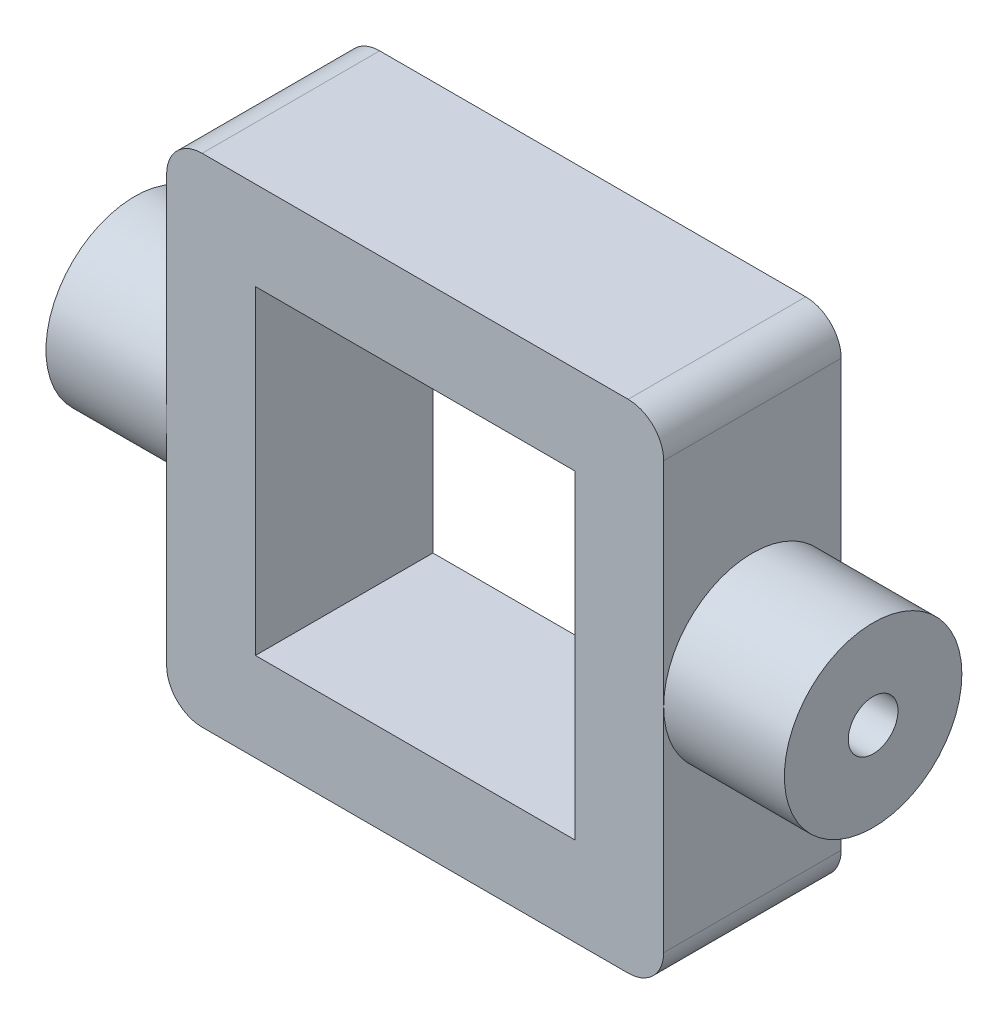
ISO-10303-21;
HEADER;
FILE_DESCRIPTION(('STEP AP214'),'2;1');
FILE_NAME('part.step','',(''),(''),'','','');
FILE_SCHEMA(('AUTOMOTIVE_DESIGN { 1 0 10303 214 1 1 1 1 }'));
ENDSEC;
DATA;
#1=APPLICATION_CONTEXT('core data for automotive mechanical design processes');
#2=APPLICATION_PROTOCOL_DEFINITION('international standard','automotive_design',2000,#1);
#3=PRODUCT_CONTEXT('',#1,'mechanical');
#4=PRODUCT('Part','Part','',(#3));
#5=PRODUCT_RELATED_PRODUCT_CATEGORY('part','',(#4));
#6=PRODUCT_DEFINITION_FORMATION('','',#4);
#7=PRODUCT_DEFINITION_CONTEXT('part definition',#1,'design');
#8=PRODUCT_DEFINITION('design','',#6,#7);
#9=PRODUCT_DEFINITION_SHAPE('','',#8);
#10=(LENGTH_UNIT() NAMED_UNIT(*) SI_UNIT(.MILLI.,.METRE.));
#11=(NAMED_UNIT(*) PLANE_ANGLE_UNIT() SI_UNIT($,.RADIAN.));
#12=(NAMED_UNIT(*) SI_UNIT($,.STERADIAN.) SOLID_ANGLE_UNIT());
#13=UNCERTAINTY_MEASURE_WITH_UNIT(LENGTH_MEASURE(1.E-05),#10,'distance_accuracy_value','');
#14=(GEOMETRIC_REPRESENTATION_CONTEXT(3) GLOBAL_UNCERTAINTY_ASSIGNED_CONTEXT((#13)) GLOBAL_UNIT_ASSIGNED_CONTEXT((#10,
#11,#12)) REPRESENTATION_CONTEXT('',''));
#15=CARTESIAN_POINT('',(0.,0.,0.));
#16=DIRECTION('',(0.,0.,1.));
#17=DIRECTION('',(1.,0.,0.));
#18=AXIS2_PLACEMENT_3D('',#15,#16,#17);
#19=CARTESIAN_POINT('',(-7.,-7.,2.5));
#20=DIRECTION('',(1.,0.,0.));
#21=DIRECTION('',(0.,0.,-1.));
#22=AXIS2_PLACEMENT_3D('',#19,#20,#21);
#23=PLANE('',#22);
#24=DIRECTION('',(0.,-1.,0.));
#25=VECTOR('',#24,1.);
#26=CARTESIAN_POINT('',(-7.,-7.,2.5));
#27=LINE('',#26,#25);
#28=CARTESIAN_POINT('',(-7.,6.,2.5));
#29=VERTEX_POINT('',#28);
#30=CARTESIAN_POINT('',(-7.,0.,2.5));
#31=VERTEX_POINT('',#30);
#32=EDGE_CURVE('E135',#29,#31,#27,.T.);
#33=ORIENTED_EDGE('',*,*,#32,.F.);
#34=DIRECTION('',(0.,0.,-1.));
#35=VECTOR('',#34,1.);
#36=CARTESIAN_POINT('',(-7.,6.,2.5));
#37=LINE('',#36,#35);
#38=CARTESIAN_POINT('',(-7.,6.,-2.5));
#39=VERTEX_POINT('',#38);
#40=EDGE_CURVE('E160',#29,#39,#37,.T.);
#41=ORIENTED_EDGE('',*,*,#40,.T.);
#42=DIRECTION('',(0.,-1.,0.));
#43=VECTOR('',#42,1.);
#44=CARTESIAN_POINT('',(-7.,-7.,-2.5));
#45=LINE('',#44,#43);
#46=CARTESIAN_POINT('',(-7.,0.,-2.5));
#47=VERTEX_POINT('',#46);
#48=EDGE_CURVE('E164',#39,#47,#45,.T.);
#49=ORIENTED_EDGE('',*,*,#48,.T.);
#50=CARTESIAN_POINT('',(-7.,0.,0.));
#51=DIRECTION('',(1.,0.,0.));
#52=DIRECTION('',(0.,0.,-1.));
#53=AXIS2_PLACEMENT_3D('',#50,#51,#52);
#54=CIRCLE('',#53,2.5);
#55=EDGE_CURVE('E156',#47,#31,#54,.T.);
#56=ORIENTED_EDGE('',*,*,#55,.T.);
#57=EDGE_LOOP('',(#33,#41,#49,#56));
#58=FACE_BOUND('',#57,.T.);
#59=ADVANCED_FACE('F34',(#58),#23,.F.);
#60=CARTESIAN_POINT('',(7.,-7.,2.5));
#61=DIRECTION('',(-1.,0.,0.));
#62=DIRECTION('',(0.,0.,1.));
#63=AXIS2_PLACEMENT_3D('',#60,#61,#62);
#64=PLANE('',#63);
#65=DIRECTION('',(0.,1.,0.));
#66=VECTOR('',#65,1.);
#67=CARTESIAN_POINT('',(7.,-7.,-2.5));
#68=LINE('',#67,#66);
#69=CARTESIAN_POINT('',(7.,0.,-2.5));
#70=VERTEX_POINT('',#69);
#71=CARTESIAN_POINT('',(7.,6.,-2.5));
#72=VERTEX_POINT('',#71);
#73=EDGE_CURVE('E189',#70,#72,#68,.T.);
#74=ORIENTED_EDGE('',*,*,#73,.T.);
#75=DIRECTION('',(0.,0.,-1.));
#76=VECTOR('',#75,1.);
#77=CARTESIAN_POINT('',(7.,6.,2.5));
#78=LINE('',#77,#76);
#79=CARTESIAN_POINT('',(7.,6.,2.5));
#80=VERTEX_POINT('',#79);
#81=EDGE_CURVE('E11',#72,#80,#78,.F.);
#82=ORIENTED_EDGE('',*,*,#81,.T.);
#83=DIRECTION('',(0.,1.,0.));
#84=VECTOR('',#83,1.);
#85=CARTESIAN_POINT('',(7.,-7.,2.5));
#86=LINE('',#85,#84);
#87=CARTESIAN_POINT('',(7.,0.,2.5));
#88=VERTEX_POINT('',#87);
#89=EDGE_CURVE('E179',#88,#80,#86,.T.);
#90=ORIENTED_EDGE('',*,*,#89,.F.);
#91=CARTESIAN_POINT('',(7.,0.,0.));
#92=DIRECTION('',(1.,0.,0.));
#93=DIRECTION('',(0.,0.,-1.));
#94=AXIS2_PLACEMENT_3D('',#91,#92,#93);
#95=CIRCLE('',#94,2.5);
#96=EDGE_CURVE('E231',#70,#88,#95,.T.);
#97=ORIENTED_EDGE('',*,*,#96,.F.);
#98=EDGE_LOOP('',(#74,#82,#90,#97));
#99=FACE_BOUND('',#98,.T.);
#100=ADVANCED_FACE('F233',(#99),#64,.F.);
#101=CARTESIAN_POINT('',(0.,0.,2.5));
#102=DIRECTION('',(0.,0.,1.));
#103=DIRECTION('',(1.,0.,0.));
#104=AXIS2_PLACEMENT_3D('',#101,#102,#103);
#105=PLANE('',#104);
#106=DIRECTION('',(-1.,0.,0.));
#107=VECTOR('',#106,1.);
#108=CARTESIAN_POINT('',(7.,7.,2.5));
#109=LINE('',#108,#107);
#110=CARTESIAN_POINT('',(6.,7.,2.5));
#111=VERTEX_POINT('',#110);
#112=CARTESIAN_POINT('',(-6.,7.,2.5));
#113=VERTEX_POINT('',#112);
#114=EDGE_CURVE('E182',#111,#113,#109,.T.);
#115=ORIENTED_EDGE('',*,*,#114,.T.);
#116=CARTESIAN_POINT('',(-6.,6.,2.5));
#117=DIRECTION('',(0.,0.,1.));
#118=DIRECTION('',(1.,0.,0.));
#119=AXIS2_PLACEMENT_3D('',#116,#117,#118);
#120=CIRCLE('',#119,1.);
#121=EDGE_CURVE('E144',#113,#29,#120,.T.);
#122=ORIENTED_EDGE('',*,*,#121,.T.);
#123=ORIENTED_EDGE('',*,*,#32,.T.);
#124=CARTESIAN_POINT('',(-7.,-6.,2.5));
#125=VERTEX_POINT('',#124);
#126=EDGE_CURVE('E141',#31,#125,#27,.T.);
#127=ORIENTED_EDGE('',*,*,#126,.T.);
#128=CARTESIAN_POINT('',(-6.,-6.,2.5));
#129=DIRECTION('',(0.,0.,1.));
#130=DIRECTION('',(1.,0.,0.));
#131=AXIS2_PLACEMENT_3D('',#128,#129,#130);
#132=CIRCLE('',#131,1.);
#133=CARTESIAN_POINT('',(-6.,-7.,2.5));
#134=VERTEX_POINT('',#133);
#135=EDGE_CURVE('E208',#125,#134,#132,.T.);
#136=ORIENTED_EDGE('',*,*,#135,.T.);
#137=DIRECTION('',(1.,0.,0.));
#138=VECTOR('',#137,1.);
#139=CARTESIAN_POINT('',(7.,-7.,2.5));
#140=LINE('',#139,#138);
#141=CARTESIAN_POINT('',(6.,-7.,2.5));
#142=VERTEX_POINT('',#141);
#143=EDGE_CURVE('E149',#134,#142,#140,.T.);
#144=ORIENTED_EDGE('',*,*,#143,.T.);
#145=CARTESIAN_POINT('',(6.,-6.,2.5));
#146=DIRECTION('',(0.,0.,1.));
#147=DIRECTION('',(1.,0.,0.));
#148=AXIS2_PLACEMENT_3D('',#145,#146,#147);
#149=CIRCLE('',#148,1.);
#150=CARTESIAN_POINT('',(7.,-6.,2.5));
#151=VERTEX_POINT('',#150);
#152=EDGE_CURVE('E55',#142,#151,#149,.T.);
#153=ORIENTED_EDGE('',*,*,#152,.T.);
#154=EDGE_CURVE('E180',#151,#88,#86,.T.);
#155=ORIENTED_EDGE('',*,*,#154,.T.);
#156=ORIENTED_EDGE('',*,*,#89,.T.);
#157=CARTESIAN_POINT('',(6.,6.,2.5));
#158=DIRECTION('',(0.,0.,1.));
#159=DIRECTION('',(1.,0.,0.));
#160=AXIS2_PLACEMENT_3D('',#157,#158,#159);
#161=CIRCLE('',#160,1.);
#162=EDGE_CURVE('E205',#80,#111,#161,.T.);
#163=ORIENTED_EDGE('',*,*,#162,.T.);
#164=EDGE_LOOP('',(#115,#122,#123,#127,#136,#144,#153,#155,#156,#163));
#165=FACE_BOUND('',#164,.T.);
#166=DIRECTION('',(1.,0.,0.));
#167=VECTOR('',#166,1.);
#168=CARTESIAN_POINT('',(4.5,-4.5,2.5));
#169=LINE('',#168,#167);
#170=CARTESIAN_POINT('',(-4.5,-4.5,2.5));
#171=VERTEX_POINT('',#170);
#172=CARTESIAN_POINT('',(4.5,-4.5,2.5));
#173=VERTEX_POINT('',#172);
#174=EDGE_CURVE('E244',#171,#173,#169,.T.);
#175=ORIENTED_EDGE('',*,*,#174,.F.);
#176=DIRECTION('',(0.,-1.,0.));
#177=VECTOR('',#176,1.);
#178=CARTESIAN_POINT('',(-4.5,-4.5,2.5));
#179=LINE('',#178,#177);
#180=CARTESIAN_POINT('',(-4.5,4.5,2.5));
#181=VERTEX_POINT('',#180);
#182=EDGE_CURVE('E242',#181,#171,#179,.T.);
#183=ORIENTED_EDGE('',*,*,#182,.F.);
#184=DIRECTION('',(-1.,0.,0.));
#185=VECTOR('',#184,1.);
#186=CARTESIAN_POINT('',(4.5,4.5,2.5));
#187=LINE('',#186,#185);
#188=CARTESIAN_POINT('',(4.5,4.5,2.5));
#189=VERTEX_POINT('',#188);
#190=EDGE_CURVE('E250',#189,#181,#187,.T.);
#191=ORIENTED_EDGE('',*,*,#190,.F.);
#192=DIRECTION('',(0.,1.,0.));
#193=VECTOR('',#192,1.);
#194=CARTESIAN_POINT('',(4.5,-4.5,2.5));
#195=LINE('',#194,#193);
#196=EDGE_CURVE('E247',#173,#189,#195,.T.);
#197=ORIENTED_EDGE('',*,*,#196,.F.);
#198=EDGE_LOOP('',(#175,#183,#191,#197));
#199=FACE_BOUND('',#198,.T.);
#200=ADVANCED_FACE('F138',(#165,#199),#105,.T.);
#201=CARTESIAN_POINT('',(0.,0.,-2.5));
#202=DIRECTION('',(0.,0.,1.));
#203=DIRECTION('',(1.,0.,0.));
#204=AXIS2_PLACEMENT_3D('',#201,#202,#203);
#205=PLANE('',#204);
#206=ORIENTED_EDGE('',*,*,#48,.F.);
#207=CARTESIAN_POINT('',(-6.,6.,-2.5));
#208=DIRECTION('',(0.,0.,1.));
#209=DIRECTION('',(1.,0.,0.));
#210=AXIS2_PLACEMENT_3D('',#207,#208,#209);
#211=CIRCLE('',#210,1.);
#212=CARTESIAN_POINT('',(-6.,7.,-2.5));
#213=VERTEX_POINT('',#212);
#214=EDGE_CURVE('E198',#39,#213,#211,.F.);
#215=ORIENTED_EDGE('',*,*,#214,.T.);
#216=DIRECTION('',(-1.,0.,0.));
#217=VECTOR('',#216,1.);
#218=CARTESIAN_POINT('',(7.,7.,-2.5));
#219=LINE('',#218,#217);
#220=CARTESIAN_POINT('',(6.,7.,-2.5));
#221=VERTEX_POINT('',#220);
#222=EDGE_CURVE('E170',#221,#213,#219,.T.);
#223=ORIENTED_EDGE('',*,*,#222,.F.);
#224=CARTESIAN_POINT('',(6.,6.,-2.5));
#225=DIRECTION('',(0.,0.,1.));
#226=DIRECTION('',(1.,0.,0.));
#227=AXIS2_PLACEMENT_3D('',#224,#225,#226);
#228=CIRCLE('',#227,1.);
#229=EDGE_CURVE('E192',#221,#72,#228,.F.);
#230=ORIENTED_EDGE('',*,*,#229,.T.);
#231=ORIENTED_EDGE('',*,*,#73,.F.);
#232=CARTESIAN_POINT('',(7.,-6.,-2.5));
#233=VERTEX_POINT('',#232);
#234=EDGE_CURVE('E172',#233,#70,#68,.T.);
#235=ORIENTED_EDGE('',*,*,#234,.F.);
#236=CARTESIAN_POINT('',(6.,-6.,-2.5));
#237=DIRECTION('',(0.,0.,1.));
#238=DIRECTION('',(1.,0.,0.));
#239=AXIS2_PLACEMENT_3D('',#236,#237,#238);
#240=CIRCLE('',#239,1.);
#241=CARTESIAN_POINT('',(6.,-7.,-2.5));
#242=VERTEX_POINT('',#241);
#243=EDGE_CURVE('E194',#233,#242,#240,.F.);
#244=ORIENTED_EDGE('',*,*,#243,.T.);
#245=DIRECTION('',(1.,0.,0.));
#246=VECTOR('',#245,1.);
#247=CARTESIAN_POINT('',(7.,-7.,-2.5));
#248=LINE('',#247,#246);
#249=CARTESIAN_POINT('',(-6.,-7.,-2.5));
#250=VERTEX_POINT('',#249);
#251=EDGE_CURVE('E185',#250,#242,#248,.T.);
#252=ORIENTED_EDGE('',*,*,#251,.F.);
#253=CARTESIAN_POINT('',(-6.,-6.,-2.5));
#254=DIRECTION('',(0.,0.,1.));
#255=DIRECTION('',(1.,0.,0.));
#256=AXIS2_PLACEMENT_3D('',#253,#254,#255);
#257=CIRCLE('',#256,1.);
#258=CARTESIAN_POINT('',(-7.,-6.,-2.5));
#259=VERTEX_POINT('',#258);
#260=EDGE_CURVE('E196',#250,#259,#257,.F.);
#261=ORIENTED_EDGE('',*,*,#260,.T.);
#262=EDGE_CURVE('E186',#47,#259,#45,.T.);
#263=ORIENTED_EDGE('',*,*,#262,.F.);
#264=EDGE_LOOP('',(#206,#215,#223,#230,#231,#235,#244,#252,#261,#263));
#265=FACE_BOUND('',#264,.T.);
#266=DIRECTION('',(0.,-1.,0.));
#267=VECTOR('',#266,1.);
#268=CARTESIAN_POINT('',(-4.5,-4.5,-2.5));
#269=LINE('',#268,#267);
#270=CARTESIAN_POINT('',(-4.5,4.5,-2.5));
#271=VERTEX_POINT('',#270);
#272=CARTESIAN_POINT('',(-4.5,-4.5,-2.5));
#273=VERTEX_POINT('',#272);
#274=EDGE_CURVE('E253',#271,#273,#269,.T.);
#275=ORIENTED_EDGE('',*,*,#274,.T.);
#276=DIRECTION('',(1.,0.,0.));
#277=VECTOR('',#276,1.);
#278=CARTESIAN_POINT('',(4.5,-4.5,-2.5));
#279=LINE('',#278,#277);
#280=CARTESIAN_POINT('',(4.5,-4.5,-2.5));
#281=VERTEX_POINT('',#280);
#282=EDGE_CURVE('E256',#273,#281,#279,.T.);
#283=ORIENTED_EDGE('',*,*,#282,.T.);
#284=DIRECTION('',(0.,1.,0.));
#285=VECTOR('',#284,1.);
#286=CARTESIAN_POINT('',(4.5,-4.5,-2.5));
#287=LINE('',#286,#285);
#288=CARTESIAN_POINT('',(4.5,4.5,-2.5));
#289=VERTEX_POINT('',#288);
#290=EDGE_CURVE('E259',#281,#289,#287,.T.);
#291=ORIENTED_EDGE('',*,*,#290,.T.);
#292=DIRECTION('',(-1.,0.,0.));
#293=VECTOR('',#292,1.);
#294=CARTESIAN_POINT('',(4.5,4.5,-2.5));
#295=LINE('',#294,#293);
#296=EDGE_CURVE('E245',#289,#271,#295,.T.);
#297=ORIENTED_EDGE('',*,*,#296,.T.);
#298=EDGE_LOOP('',(#275,#283,#291,#297));
#299=FACE_BOUND('',#298,.T.);
#300=ADVANCED_FACE('F225',(#265,#299),#205,.F.);
#301=ORIENTED_EDGE('',*,*,#262,.T.);
#302=DIRECTION('',(0.,0.,-1.));
#303=VECTOR('',#302,1.);
#304=CARTESIAN_POINT('',(-7.,-6.,2.5));
#305=LINE('',#304,#303);
#306=EDGE_CURVE('E169',#259,#125,#305,.F.);
#307=ORIENTED_EDGE('',*,*,#306,.T.);
#308=ORIENTED_EDGE('',*,*,#126,.F.);
#309=EDGE_CURVE('E154',#31,#47,#54,.T.);
#310=ORIENTED_EDGE('',*,*,#309,.T.);
#311=EDGE_LOOP('',(#301,#307,#308,#310));
#312=FACE_BOUND('',#311,.T.);
#313=ADVANCED_FACE('F167',(#312),#23,.F.);
#314=CARTESIAN_POINT('',(7.,-7.,2.5));
#315=DIRECTION('',(0.,1.,0.));
#316=DIRECTION('',(0.,0.,1.));
#317=AXIS2_PLACEMENT_3D('',#314,#315,#316);
#318=PLANE('',#317);
#319=ORIENTED_EDGE('',*,*,#143,.F.);
#320=DIRECTION('',(0.,0.,-1.));
#321=VECTOR('',#320,1.);
#322=CARTESIAN_POINT('',(-6.,-7.,2.5));
#323=LINE('',#322,#321);
#324=EDGE_CURVE('E213',#134,#250,#323,.T.);
#325=ORIENTED_EDGE('',*,*,#324,.T.);
#326=ORIENTED_EDGE('',*,*,#251,.T.);
#327=DIRECTION('',(0.,0.,-1.));
#328=VECTOR('',#327,1.);
#329=CARTESIAN_POINT('',(6.,-7.,2.5));
#330=LINE('',#329,#328);
#331=EDGE_CURVE('E211',#242,#142,#330,.F.);
#332=ORIENTED_EDGE('',*,*,#331,.T.);
#333=EDGE_LOOP('',(#319,#325,#326,#332));
#334=FACE_BOUND('',#333,.T.);
#335=ADVANCED_FACE('F279',(#334),#318,.F.);
#336=ORIENTED_EDGE('',*,*,#154,.F.);
#337=DIRECTION('',(0.,0.,-1.));
#338=VECTOR('',#337,1.);
#339=CARTESIAN_POINT('',(7.,-6.,2.5));
#340=LINE('',#339,#338);
#341=EDGE_CURVE('E42',#151,#233,#340,.T.);
#342=ORIENTED_EDGE('',*,*,#341,.T.);
#343=ORIENTED_EDGE('',*,*,#234,.T.);
#344=EDGE_CURVE('E161',#88,#70,#95,.T.);
#345=ORIENTED_EDGE('',*,*,#344,.F.);
#346=EDGE_LOOP('',(#336,#342,#343,#345));
#347=FACE_BOUND('',#346,.T.);
#348=ADVANCED_FACE('F220',(#347),#64,.F.);
#349=CARTESIAN_POINT('',(7.,7.,2.5));
#350=DIRECTION('',(0.,-1.,0.));
#351=DIRECTION('',(0.,0.,-1.));
#352=AXIS2_PLACEMENT_3D('',#349,#350,#351);
#353=PLANE('',#352);
#354=ORIENTED_EDGE('',*,*,#222,.T.);
#355=DIRECTION('',(0.,0.,-1.));
#356=VECTOR('',#355,1.);
#357=CARTESIAN_POINT('',(-6.,7.,2.5));
#358=LINE('',#357,#356);
#359=EDGE_CURVE('E203',#213,#113,#358,.F.);
#360=ORIENTED_EDGE('',*,*,#359,.T.);
#361=ORIENTED_EDGE('',*,*,#114,.F.);
#362=DIRECTION('',(0.,0.,-1.));
#363=VECTOR('',#362,1.);
#364=CARTESIAN_POINT('',(6.,7.,2.5));
#365=LINE('',#364,#363);
#366=EDGE_CURVE('E200',#111,#221,#365,.T.);
#367=ORIENTED_EDGE('',*,*,#366,.T.);
#368=EDGE_LOOP('',(#354,#360,#361,#367));
#369=FACE_BOUND('',#368,.T.);
#370=ADVANCED_FACE('F310',(#369),#353,.F.);
#371=CARTESIAN_POINT('',(-4.5,-4.5,2.5));
#372=DIRECTION('',(1.,0.,0.));
#373=DIRECTION('',(0.,0.,-1.));
#374=AXIS2_PLACEMENT_3D('',#371,#372,#373);
#375=PLANE('',#374);
#376=ORIENTED_EDGE('',*,*,#274,.F.);
#377=DIRECTION('',(0.,0.,-1.));
#378=VECTOR('',#377,1.);
#379=CARTESIAN_POINT('',(-4.5,4.5,2.5));
#380=LINE('',#379,#378);
#381=EDGE_CURVE('E252',#181,#271,#380,.T.);
#382=ORIENTED_EDGE('',*,*,#381,.F.);
#383=ORIENTED_EDGE('',*,*,#182,.T.);
#384=DIRECTION('',(0.,0.,-1.));
#385=VECTOR('',#384,1.);
#386=CARTESIAN_POINT('',(-4.5,-4.5,2.5));
#387=LINE('',#386,#385);
#388=EDGE_CURVE('E176',#171,#273,#387,.T.);
#389=ORIENTED_EDGE('',*,*,#388,.T.);
#390=EDGE_LOOP('',(#376,#382,#383,#389));
#391=FACE_BOUND('',#390,.T.);
#392=ADVANCED_FACE('F312',(#391),#375,.T.);
#393=CARTESIAN_POINT('',(4.5,-4.5,2.5));
#394=DIRECTION('',(0.,1.,0.));
#395=DIRECTION('',(0.,0.,1.));
#396=AXIS2_PLACEMENT_3D('',#393,#394,#395);
#397=PLANE('',#396);
#398=ORIENTED_EDGE('',*,*,#282,.F.);
#399=ORIENTED_EDGE('',*,*,#388,.F.);
#400=ORIENTED_EDGE('',*,*,#174,.T.);
#401=DIRECTION('',(0.,0.,-1.));
#402=VECTOR('',#401,1.);
#403=CARTESIAN_POINT('',(4.5,-4.5,2.5));
#404=LINE('',#403,#402);
#405=EDGE_CURVE('E267',#173,#281,#404,.T.);
#406=ORIENTED_EDGE('',*,*,#405,.T.);
#407=EDGE_LOOP('',(#398,#399,#400,#406));
#408=FACE_BOUND('',#407,.T.);
#409=ADVANCED_FACE('F330',(#408),#397,.T.);
#410=CARTESIAN_POINT('',(4.5,-4.5,2.5));
#411=DIRECTION('',(-1.,0.,0.));
#412=DIRECTION('',(0.,0.,1.));
#413=AXIS2_PLACEMENT_3D('',#410,#411,#412);
#414=PLANE('',#413);
#415=ORIENTED_EDGE('',*,*,#290,.F.);
#416=ORIENTED_EDGE('',*,*,#405,.F.);
#417=ORIENTED_EDGE('',*,*,#196,.T.);
#418=DIRECTION('',(0.,0.,-1.));
#419=VECTOR('',#418,1.);
#420=CARTESIAN_POINT('',(4.5,4.5,2.5));
#421=LINE('',#420,#419);
#422=EDGE_CURVE('E266',#189,#289,#421,.T.);
#423=ORIENTED_EDGE('',*,*,#422,.T.);
#424=EDGE_LOOP('',(#415,#416,#417,#423));
#425=FACE_BOUND('',#424,.T.);
#426=ADVANCED_FACE('F336',(#425),#414,.T.);
#427=CARTESIAN_POINT('',(4.5,4.5,2.5));
#428=DIRECTION('',(0.,-1.,0.));
#429=DIRECTION('',(0.,0.,-1.));
#430=AXIS2_PLACEMENT_3D('',#427,#428,#429);
#431=PLANE('',#430);
#432=ORIENTED_EDGE('',*,*,#296,.F.);
#433=ORIENTED_EDGE('',*,*,#422,.F.);
#434=ORIENTED_EDGE('',*,*,#190,.T.);
#435=ORIENTED_EDGE('',*,*,#381,.T.);
#436=EDGE_LOOP('',(#432,#433,#434,#435));
#437=FACE_BOUND('',#436,.T.);
#438=ADVANCED_FACE('F343',(#437),#431,.T.);
#439=CARTESIAN_POINT('',(10.4,0.,0.));
#440=DIRECTION('',(-1.,0.,0.));
#441=DIRECTION('',(0.,0.,1.));
#442=AXIS2_PLACEMENT_3D('',#439,#440,#441);
#443=CYLINDRICAL_SURFACE('',#442,2.5);
#444=CARTESIAN_POINT('',(10.4,0.,0.));
#445=DIRECTION('',(1.,0.,0.));
#446=DIRECTION('',(0.,0.,-1.));
#447=AXIS2_PLACEMENT_3D('',#444,#445,#446);
#448=CIRCLE('',#447,2.5);
#449=CARTESIAN_POINT('',(10.4,0.,-2.5));
#450=VERTEX_POINT('',#449);
#451=EDGE_CURVE('E235',#450,#450,#448,.T.);
#452=ORIENTED_EDGE('',*,*,#451,.F.);
#453=EDGE_LOOP('',(#452));
#454=FACE_BOUND('',#453,.T.);
#455=ORIENTED_EDGE('',*,*,#96,.T.);
#456=ORIENTED_EDGE('',*,*,#344,.T.);
#457=EDGE_LOOP('',(#455,#456));
#458=FACE_BOUND('',#457,.T.);
#459=ADVANCED_FACE('F238',(#454,#458),#443,.T.);
#460=CARTESIAN_POINT('',(10.4,0.,0.));
#461=DIRECTION('',(1.,0.,0.));
#462=DIRECTION('',(0.,0.,-1.));
#463=AXIS2_PLACEMENT_3D('',#460,#461,#462);
#464=PLANE('',#463);
#465=CARTESIAN_POINT('',(10.4,0.,0.));
#466=DIRECTION('',(1.,0.,0.));
#467=DIRECTION('',(0.,0.,-1.));
#468=AXIS2_PLACEMENT_3D('',#465,#466,#467);
#469=CIRCLE('',#468,0.7);
#470=CARTESIAN_POINT('',(10.4,0.,-0.7));
#471=VERTEX_POINT('',#470);
#472=EDGE_CURVE('E507',#471,#471,#469,.T.);
#473=ORIENTED_EDGE('',*,*,#472,.F.);
#474=EDGE_LOOP('',(#473));
#475=FACE_BOUND('',#474,.T.);
#476=ORIENTED_EDGE('',*,*,#451,.T.);
#477=EDGE_LOOP('',(#476));
#478=FACE_BOUND('',#477,.T.);
#479=ADVANCED_FACE('F358',(#475,#478),#464,.T.);
#480=CARTESIAN_POINT('',(5.4,0.,0.));
#481=DIRECTION('',(1.,0.,0.));
#482=DIRECTION('',(0.,0.,-1.));
#483=AXIS2_PLACEMENT_3D('',#480,#481,#482);
#484=CYLINDRICAL_SURFACE('',#483,0.7);
#485=CARTESIAN_POINT('',(5.4,0.,0.));
#486=DIRECTION('',(1.,0.,0.));
#487=DIRECTION('',(0.,0.,-1.));
#488=AXIS2_PLACEMENT_3D('',#485,#486,#487);
#489=CIRCLE('',#488,0.7);
#490=CARTESIAN_POINT('',(5.4,0.,-0.7));
#491=VERTEX_POINT('',#490);
#492=EDGE_CURVE('E236',#491,#491,#489,.T.);
#493=ORIENTED_EDGE('',*,*,#492,.F.);
#494=EDGE_LOOP('',(#493));
#495=FACE_BOUND('',#494,.T.);
#496=ORIENTED_EDGE('',*,*,#472,.T.);
#497=EDGE_LOOP('',(#496));
#498=FACE_BOUND('',#497,.T.);
#499=ADVANCED_FACE('F366',(#495,#498),#484,.F.);
#500=CARTESIAN_POINT('',(5.4,0.,0.));
#501=DIRECTION('',(1.,0.,0.));
#502=DIRECTION('',(0.,0.,-1.));
#503=AXIS2_PLACEMENT_3D('',#500,#501,#502);
#504=PLANE('',#503);
#505=ORIENTED_EDGE('',*,*,#492,.T.);
#506=EDGE_LOOP('',(#505));
#507=FACE_BOUND('',#506,.T.);
#508=ADVANCED_FACE('F374',(#507),#504,.T.);
#509=CARTESIAN_POINT('',(-10.4,0.,0.));
#510=DIRECTION('',(1.,0.,0.));
#511=DIRECTION('',(0.,0.,-1.));
#512=AXIS2_PLACEMENT_3D('',#509,#510,#511);
#513=CYLINDRICAL_SURFACE('',#512,2.5);
#514=CARTESIAN_POINT('',(-10.4,0.,0.));
#515=DIRECTION('',(1.,0.,0.));
#516=DIRECTION('',(0.,0.,-1.));
#517=AXIS2_PLACEMENT_3D('',#514,#515,#516);
#518=CIRCLE('',#517,2.5);
#519=CARTESIAN_POINT('',(-10.4,0.,-2.5));
#520=VERTEX_POINT('',#519);
#521=EDGE_CURVE('E165',#520,#520,#518,.T.);
#522=ORIENTED_EDGE('',*,*,#521,.T.);
#523=EDGE_LOOP('',(#522));
#524=FACE_BOUND('',#523,.T.);
#525=ORIENTED_EDGE('',*,*,#55,.F.);
#526=ORIENTED_EDGE('',*,*,#309,.F.);
#527=EDGE_LOOP('',(#525,#526));
#528=FACE_BOUND('',#527,.T.);
#529=ADVANCED_FACE('F155',(#524,#528),#513,.T.);
#530=CARTESIAN_POINT('',(-10.4,0.,0.));
#531=DIRECTION('',(-1.,0.,0.));
#532=DIRECTION('',(0.,0.,-1.));
#533=AXIS2_PLACEMENT_3D('',#530,#531,#532);
#534=PLANE('',#533);
#535=CARTESIAN_POINT('',(-10.4,0.,0.));
#536=DIRECTION('',(1.,0.,0.));
#537=DIRECTION('',(0.,0.,-1.));
#538=AXIS2_PLACEMENT_3D('',#535,#536,#537);
#539=CIRCLE('',#538,0.7);
#540=CARTESIAN_POINT('',(-10.4,0.,-0.7));
#541=VERTEX_POINT('',#540);
#542=EDGE_CURVE('E501',#541,#541,#539,.T.);
#543=ORIENTED_EDGE('',*,*,#542,.T.);
#544=EDGE_LOOP('',(#543));
#545=FACE_BOUND('',#544,.T.);
#546=ORIENTED_EDGE('',*,*,#521,.F.);
#547=EDGE_LOOP('',(#546));
#548=FACE_BOUND('',#547,.T.);
#549=ADVANCED_FACE('F389',(#545,#548),#534,.T.);
#550=CARTESIAN_POINT('',(-5.4,0.,0.));
#551=DIRECTION('',(-1.,0.,0.));
#552=DIRECTION('',(0.,0.,1.));
#553=AXIS2_PLACEMENT_3D('',#550,#551,#552);
#554=CYLINDRICAL_SURFACE('',#553,0.7);
#555=CARTESIAN_POINT('',(-5.4,0.,0.));
#556=DIRECTION('',(1.,0.,0.));
#557=DIRECTION('',(0.,0.,-1.));
#558=AXIS2_PLACEMENT_3D('',#555,#556,#557);
#559=CIRCLE('',#558,0.7);
#560=CARTESIAN_POINT('',(-5.4,0.,-0.7));
#561=VERTEX_POINT('',#560);
#562=EDGE_CURVE('E166',#561,#561,#559,.T.);
#563=ORIENTED_EDGE('',*,*,#562,.T.);
#564=EDGE_LOOP('',(#563));
#565=FACE_BOUND('',#564,.T.);
#566=ORIENTED_EDGE('',*,*,#542,.F.);
#567=EDGE_LOOP('',(#566));
#568=FACE_BOUND('',#567,.T.);
#569=ADVANCED_FACE('F397',(#565,#568),#554,.F.);
#570=CARTESIAN_POINT('',(-5.4,0.,0.));
#571=DIRECTION('',(-1.,0.,0.));
#572=DIRECTION('',(0.,0.,-1.));
#573=AXIS2_PLACEMENT_3D('',#570,#571,#572);
#574=PLANE('',#573);
#575=ORIENTED_EDGE('',*,*,#562,.F.);
#576=EDGE_LOOP('',(#575));
#577=FACE_BOUND('',#576,.T.);
#578=ADVANCED_FACE('F405',(#577),#574,.T.);
#579=CARTESIAN_POINT('',(-6.,6.,2.5));
#580=DIRECTION('',(0.,0.,-1.));
#581=DIRECTION('',(-1.,0.,0.));
#582=AXIS2_PLACEMENT_3D('',#579,#580,#581);
#583=CYLINDRICAL_SURFACE('',#582,1.);
#584=ORIENTED_EDGE('',*,*,#121,.F.);
#585=ORIENTED_EDGE('',*,*,#359,.F.);
#586=ORIENTED_EDGE('',*,*,#214,.F.);
#587=ORIENTED_EDGE('',*,*,#40,.F.);
#588=EDGE_LOOP('',(#584,#585,#586,#587));
#589=FACE_BOUND('',#588,.T.);
#590=ADVANCED_FACE('F288',(#589),#583,.T.);
#591=CARTESIAN_POINT('',(-6.,-6.,2.5));
#592=DIRECTION('',(0.,0.,-1.));
#593=DIRECTION('',(-1.,0.,0.));
#594=AXIS2_PLACEMENT_3D('',#591,#592,#593);
#595=CYLINDRICAL_SURFACE('',#594,1.);
#596=ORIENTED_EDGE('',*,*,#135,.F.);
#597=ORIENTED_EDGE('',*,*,#306,.F.);
#598=ORIENTED_EDGE('',*,*,#260,.F.);
#599=ORIENTED_EDGE('',*,*,#324,.F.);
#600=EDGE_LOOP('',(#596,#597,#598,#599));
#601=FACE_BOUND('',#600,.T.);
#602=ADVANCED_FACE('F275',(#601),#595,.T.);
#603=CARTESIAN_POINT('',(6.,-6.,2.5));
#604=DIRECTION('',(0.,0.,-1.));
#605=DIRECTION('',(-1.,0.,0.));
#606=AXIS2_PLACEMENT_3D('',#603,#604,#605);
#607=CYLINDRICAL_SURFACE('',#606,1.);
#608=ORIENTED_EDGE('',*,*,#152,.F.);
#609=ORIENTED_EDGE('',*,*,#331,.F.);
#610=ORIENTED_EDGE('',*,*,#243,.F.);
#611=ORIENTED_EDGE('',*,*,#341,.F.);
#612=EDGE_LOOP('',(#608,#609,#610,#611));
#613=FACE_BOUND('',#612,.T.);
#614=ADVANCED_FACE('F281',(#613),#607,.T.);
#615=CARTESIAN_POINT('',(6.,6.,2.5));
#616=DIRECTION('',(0.,0.,-1.));
#617=DIRECTION('',(-1.,0.,0.));
#618=AXIS2_PLACEMENT_3D('',#615,#616,#617);
#619=CYLINDRICAL_SURFACE('',#618,1.);
#620=ORIENTED_EDGE('',*,*,#162,.F.);
#621=ORIENTED_EDGE('',*,*,#81,.F.);
#622=ORIENTED_EDGE('',*,*,#229,.F.);
#623=ORIENTED_EDGE('',*,*,#366,.F.);
#624=EDGE_LOOP('',(#620,#621,#622,#623));
#625=FACE_BOUND('',#624,.T.);
#626=ADVANCED_FACE('F36',(#625),#619,.T.);
#627=CLOSED_SHELL('',(#59,#100,#200,#300,#313,#335,#348,#370,#392,#409,#426,#438,#459,#479,#499,
#508,#529,#549,#569,#578,#590,#602,#614,#626));
#628=MANIFOLD_SOLID_BREP('B2',#627);
#629=ADVANCED_BREP_SHAPE_REPRESENTATION('',(#18,#628),#14);
#630=SHAPE_DEFINITION_REPRESENTATION(#9,#629);
ENDSEC;
END-ISO-10303-21;
